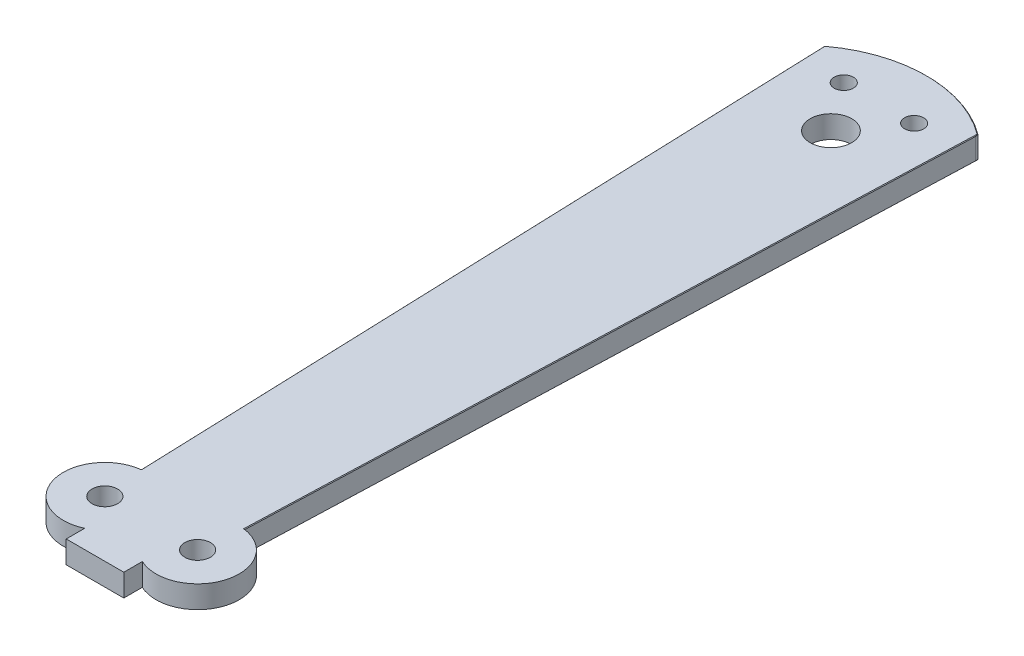
ISO-10303-21;
HEADER;
FILE_DESCRIPTION(('STEP AP214'),'2;1');
FILE_NAME('part.step','',(''),(''),'','','');
FILE_SCHEMA(('AUTOMOTIVE_DESIGN { 1 0 10303 214 1 1 1 1 }'));
ENDSEC;
DATA;
#1=APPLICATION_CONTEXT('core data for automotive mechanical design processes');
#2=APPLICATION_PROTOCOL_DEFINITION('international standard','automotive_design',2000,#1);
#3=PRODUCT_CONTEXT('',#1,'mechanical');
#4=PRODUCT('Part','Part','',(#3));
#5=PRODUCT_RELATED_PRODUCT_CATEGORY('part','',(#4));
#6=PRODUCT_DEFINITION_FORMATION('','',#4);
#7=PRODUCT_DEFINITION_CONTEXT('part definition',#1,'design');
#8=PRODUCT_DEFINITION('design','',#6,#7);
#9=PRODUCT_DEFINITION_SHAPE('','',#8);
#10=(LENGTH_UNIT() NAMED_UNIT(*) SI_UNIT(.MILLI.,.METRE.));
#11=(NAMED_UNIT(*) PLANE_ANGLE_UNIT() SI_UNIT($,.RADIAN.));
#12=(NAMED_UNIT(*) SI_UNIT($,.STERADIAN.) SOLID_ANGLE_UNIT());
#13=UNCERTAINTY_MEASURE_WITH_UNIT(LENGTH_MEASURE(1.E-05),#10,'distance_accuracy_value','');
#14=(GEOMETRIC_REPRESENTATION_CONTEXT(3) GLOBAL_UNCERTAINTY_ASSIGNED_CONTEXT((#13)) GLOBAL_UNIT_ASSIGNED_CONTEXT((#10,
#11,#12)) REPRESENTATION_CONTEXT('',''));
#15=CARTESIAN_POINT('',(0.,0.,0.));
#16=DIRECTION('',(0.,0.,1.));
#17=DIRECTION('',(1.,0.,0.));
#18=AXIS2_PLACEMENT_3D('',#15,#16,#17);
#19=CARTESIAN_POINT('',(0.,-1.75,20.));
#20=DIRECTION('',(0.,1.,0.));
#21=DIRECTION('',(0.,0.,1.));
#22=AXIS2_PLACEMENT_3D('',#19,#20,#21);
#23=CYLINDRICAL_SURFACE('',#22,20.);
#24=DIRECTION('',(0.,1.,0.));
#25=VECTOR('',#24,1.);
#26=CARTESIAN_POINT('',(11.9200497518595,-1.75,3.94034826301659));
#27=LINE('',#26,#25);
#28=CARTESIAN_POINT('',(11.9200497518595,1.65000000000001,3.94034826301659));
#29=VERTEX_POINT('',#28);
#30=CARTESIAN_POINT('',(11.9200497518595,-1.65,3.94034826301659));
#31=VERTEX_POINT('',#30);
#32=EDGE_CURVE('E259',#29,#31,#27,.F.);
#33=ORIENTED_EDGE('',*,*,#32,.T.);
#34=CARTESIAN_POINT('',(0.,-1.65,20.));
#35=DIRECTION('',(0.,-1.,0.));
#36=DIRECTION('',(0.,0.,-1.));
#37=AXIS2_PLACEMENT_3D('',#34,#35,#36);
#38=CIRCLE('',#37,20.);
#39=CARTESIAN_POINT('',(-11.693240419358,-1.65,3.77446061004157));
#40=VERTEX_POINT('',#39);
#41=EDGE_CURVE('E263',#31,#40,#38,.F.);
#42=ORIENTED_EDGE('',*,*,#41,.T.);
#43=DIRECTION('',(0.,1.,0.));
#44=VECTOR('',#43,1.);
#45=CARTESIAN_POINT('',(-11.693240419358,-1.75,3.77446061004157));
#46=LINE('',#45,#44);
#47=CARTESIAN_POINT('',(-11.693240419358,1.65000000000001,3.77446061004156));
#48=VERTEX_POINT('',#47);
#49=EDGE_CURVE('E256',#40,#48,#46,.T.);
#50=ORIENTED_EDGE('',*,*,#49,.T.);
#51=CARTESIAN_POINT('',(0.,1.65000000000001,20.));
#52=DIRECTION('',(0.,-1.,0.));
#53=DIRECTION('',(0.,0.,-1.));
#54=AXIS2_PLACEMENT_3D('',#51,#52,#53);
#55=CIRCLE('',#54,20.);
#56=EDGE_CURVE('E253',#48,#29,#55,.T.);
#57=ORIENTED_EDGE('',*,*,#56,.T.);
#58=EDGE_LOOP('',(#33,#42,#50,#57));
#59=FACE_BOUND('',#58,.T.);
#60=ADVANCED_FACE('F49',(#59),#23,.T.);
#61=CARTESIAN_POINT('',(12.,-1.75,4.));
#62=DIRECTION('',(0.999374674114514,0.,0.0353590262664188));
#63=DIRECTION('',(0.0353590262664188,0.,-0.999374674114514));
#64=AXIS2_PLACEMENT_3D('',#61,#62,#63);
#65=PLANE('',#64);
#66=DIRECTION('',(0.,1.,0.));
#67=VECTOR('',#66,1.);
#68=CARTESIAN_POINT('',(8.08082184465976,-1.75,114.770227728518));
#69=LINE('',#68,#67);
#70=CARTESIAN_POINT('',(8.08082184465976,-1.65,114.770227728518));
#71=VERTEX_POINT('',#70);
#72=CARTESIAN_POINT('',(8.08082184465976,1.65000000000001,114.770227728518));
#73=VERTEX_POINT('',#72);
#74=EDGE_CURVE('E228',#71,#73,#69,.T.);
#75=ORIENTED_EDGE('',*,*,#74,.F.);
#76=DIRECTION('',(0.0353590262664188,0.,-0.999374674114514));
#77=VECTOR('',#76,1.);
#78=CARTESIAN_POINT('',(12.,-1.65,4.));
#79=LINE('',#78,#77);
#80=CARTESIAN_POINT('',(11.9858210880633,-1.65,4.40074761644322));
#81=VERTEX_POINT('',#80);
#82=EDGE_CURVE('E250',#71,#81,#79,.T.);
#83=ORIENTED_EDGE('',*,*,#82,.T.);
#84=DIRECTION('',(0.,1.,0.));
#85=VECTOR('',#84,1.);
#86=CARTESIAN_POINT('',(11.9858210880633,-1.75,4.40074761644322));
#87=LINE('',#86,#85);
#88=CARTESIAN_POINT('',(11.9858210880633,1.65000000000001,4.40074761644322));
#89=VERTEX_POINT('',#88);
#90=EDGE_CURVE('E246',#81,#89,#87,.T.);
#91=ORIENTED_EDGE('',*,*,#90,.T.);
#92=DIRECTION('',(-0.0353590262664188,0.,0.999374674114514));
#93=VECTOR('',#92,1.);
#94=CARTESIAN_POINT('',(8.08082184465976,1.65000000000001,114.770227728518));
#95=LINE('',#94,#93);
#96=EDGE_CURVE('E232',#89,#73,#95,.T.);
#97=ORIENTED_EDGE('',*,*,#96,.T.);
#98=EDGE_LOOP('',(#75,#83,#91,#97));
#99=FACE_BOUND('',#98,.T.);
#100=ADVANCED_FACE('F405',(#99),#65,.T.);
#101=CARTESIAN_POINT('',(7.25000000000002,-1.75,121.216911764706));
#102=DIRECTION('',(0.,1.,0.));
#103=DIRECTION('',(0.,0.,1.));
#104=AXIS2_PLACEMENT_3D('',#101,#102,#103);
#105=CYLINDRICAL_SURFACE('',#104,6.5);
#106=CARTESIAN_POINT('',(7.25000000000002,-1.75,121.216911764706));
#107=DIRECTION('',(0.,1.,0.));
#108=DIRECTION('',(0.,0.,1.));
#109=AXIS2_PLACEMENT_3D('',#106,#107,#108);
#110=CIRCLE('',#109,6.5);
#111=CARTESIAN_POINT('',(4.49999999999998,-1.75,127.106521259401));
#112=VERTEX_POINT('',#111);
#113=CARTESIAN_POINT('',(7.98118594930824,-1.75,114.758168302736));
#114=VERTEX_POINT('',#113);
#115=EDGE_CURVE('E225',#112,#114,#110,.T.);
#116=ORIENTED_EDGE('',*,*,#115,.T.);
#117=CARTESIAN_POINT('',(7.25000000000002,-2.25235384008712,121.216911764706));
#118=DIRECTION('',(-0.706664609012429,0.707106781186588,-0.0250026072491366));
#119=DIRECTION('',(0.706664609012509,0.707106781186507,0.0250026072491394));
#120=AXIS2_PLACEMENT_3D('',#117,#118,#119);
#121=ELLIPSE('',#120,9.1923881554246,6.5);
#122=EDGE_CURVE('E292',#114,#71,#121,.F.);
#123=ORIENTED_EDGE('',*,*,#122,.T.);
#124=ORIENTED_EDGE('',*,*,#74,.T.);
#125=CARTESIAN_POINT('',(7.25000000000002,2.25235384008722,121.216911764706));
#126=DIRECTION('',(0.706664609012478,0.707106781186538,0.0250026072491383));
#127=DIRECTION('',(-0.70666460901246,0.707106781186557,-0.0250026072491377));
#128=AXIS2_PLACEMENT_3D('',#125,#126,#127);
#129=ELLIPSE('',#128,9.19238815542524,6.5);
#130=CARTESIAN_POINT('',(7.98118594930827,1.75,114.758168302736));
#131=VERTEX_POINT('',#130);
#132=EDGE_CURVE('E60',#73,#131,#129,.T.);
#133=ORIENTED_EDGE('',*,*,#132,.T.);
#134=CARTESIAN_POINT('',(7.25000000000002,1.75,121.216911764706));
#135=DIRECTION('',(0.,1.,0.));
#136=DIRECTION('',(0.,0.,1.));
#137=AXIS2_PLACEMENT_3D('',#134,#135,#136);
#138=CIRCLE('',#137,6.5);
#139=CARTESIAN_POINT('',(4.49999999999998,1.75,127.106521259401));
#140=VERTEX_POINT('',#139);
#141=EDGE_CURVE('E68',#140,#131,#138,.T.);
#142=ORIENTED_EDGE('',*,*,#141,.F.);
#143=DIRECTION('',(0.,1.,0.));
#144=VECTOR('',#143,1.);
#145=CARTESIAN_POINT('',(4.49999999999998,-1.75,127.106521259401));
#146=LINE('',#145,#144);
#147=EDGE_CURVE('E233',#112,#140,#146,.T.);
#148=ORIENTED_EDGE('',*,*,#147,.F.);
#149=EDGE_LOOP('',(#116,#123,#124,#133,#142,#148));
#150=FACE_BOUND('',#149,.T.);
#151=ADVANCED_FACE('F412',(#150),#105,.T.);
#152=CARTESIAN_POINT('',(4.5,-1.75,130.));
#153=DIRECTION('',(1.,0.,0.));
#154=DIRECTION('',(0.,0.,-1.));
#155=AXIS2_PLACEMENT_3D('',#152,#153,#154);
#156=PLANE('',#155);
#157=ORIENTED_EDGE('',*,*,#147,.T.);
#158=DIRECTION('',(0.,0.,-1.));
#159=VECTOR('',#158,1.);
#160=CARTESIAN_POINT('',(4.5,1.75,130.));
#161=LINE('',#160,#159);
#162=CARTESIAN_POINT('',(4.5,1.75,130.));
#163=VERTEX_POINT('',#162);
#164=EDGE_CURVE('E184',#163,#140,#161,.T.);
#165=ORIENTED_EDGE('',*,*,#164,.F.);
#166=DIRECTION('',(0.,1.,0.));
#167=VECTOR('',#166,1.);
#168=CARTESIAN_POINT('',(4.5,-1.75,130.));
#169=LINE('',#168,#167);
#170=CARTESIAN_POINT('',(4.5,-1.75,130.));
#171=VERTEX_POINT('',#170);
#172=EDGE_CURVE('E236',#171,#163,#169,.T.);
#173=ORIENTED_EDGE('',*,*,#172,.F.);
#174=DIRECTION('',(0.,0.,-1.));
#175=VECTOR('',#174,1.);
#176=CARTESIAN_POINT('',(4.5,-1.75,130.));
#177=LINE('',#176,#175);
#178=EDGE_CURVE('E221',#171,#112,#177,.T.);
#179=ORIENTED_EDGE('',*,*,#178,.T.);
#180=EDGE_LOOP('',(#157,#165,#173,#179));
#181=FACE_BOUND('',#180,.T.);
#182=ADVANCED_FACE('F531',(#181),#156,.T.);
#183=CARTESIAN_POINT('',(-4.49999999999997,-1.75,130.));
#184=DIRECTION('',(0.,0.,1.));
#185=DIRECTION('',(1.,0.,0.));
#186=AXIS2_PLACEMENT_3D('',#183,#184,#185);
#187=PLANE('',#186);
#188=ORIENTED_EDGE('',*,*,#172,.T.);
#189=DIRECTION('',(1.,0.,0.));
#190=VECTOR('',#189,1.);
#191=CARTESIAN_POINT('',(-4.49999999999997,1.75,130.));
#192=LINE('',#191,#190);
#193=CARTESIAN_POINT('',(-4.49999999999997,1.75,130.));
#194=VERTEX_POINT('',#193);
#195=EDGE_CURVE('E181',#194,#163,#192,.T.);
#196=ORIENTED_EDGE('',*,*,#195,.F.);
#197=DIRECTION('',(0.,1.,0.));
#198=VECTOR('',#197,1.);
#199=CARTESIAN_POINT('',(-4.49999999999997,-1.75,130.));
#200=LINE('',#199,#198);
#201=CARTESIAN_POINT('',(-4.49999999999997,-1.75,130.));
#202=VERTEX_POINT('',#201);
#203=EDGE_CURVE('E164',#202,#194,#200,.T.);
#204=ORIENTED_EDGE('',*,*,#203,.F.);
#205=DIRECTION('',(1.,0.,0.));
#206=VECTOR('',#205,1.);
#207=CARTESIAN_POINT('',(-4.49999999999997,-1.75,130.));
#208=LINE('',#207,#206);
#209=EDGE_CURVE('E217',#202,#171,#208,.T.);
#210=ORIENTED_EDGE('',*,*,#209,.T.);
#211=EDGE_LOOP('',(#188,#196,#204,#210));
#212=FACE_BOUND('',#211,.T.);
#213=ADVANCED_FACE('F535',(#212),#187,.T.);
#214=CARTESIAN_POINT('',(-4.49999999999997,-1.75,130.));
#215=DIRECTION('',(-1.,0.,0.));
#216=DIRECTION('',(0.,0.,1.));
#217=AXIS2_PLACEMENT_3D('',#214,#215,#216);
#218=PLANE('',#217);
#219=ORIENTED_EDGE('',*,*,#203,.T.);
#220=DIRECTION('',(0.,0.,1.));
#221=VECTOR('',#220,1.);
#222=CARTESIAN_POINT('',(-4.49999999999997,1.75,130.));
#223=LINE('',#222,#221);
#224=CARTESIAN_POINT('',(-4.49999999999998,1.75,127.106521259401));
#225=VERTEX_POINT('',#224);
#226=EDGE_CURVE('E171',#225,#194,#223,.T.);
#227=ORIENTED_EDGE('',*,*,#226,.F.);
#228=DIRECTION('',(0.,1.,0.));
#229=VECTOR('',#228,1.);
#230=CARTESIAN_POINT('',(-4.49999999999998,-1.75,127.106521259401));
#231=LINE('',#230,#229);
#232=CARTESIAN_POINT('',(-4.49999999999998,-1.75,127.106521259401));
#233=VERTEX_POINT('',#232);
#234=EDGE_CURVE('E152',#233,#225,#231,.T.);
#235=ORIENTED_EDGE('',*,*,#234,.F.);
#236=DIRECTION('',(0.,0.,1.));
#237=VECTOR('',#236,1.);
#238=CARTESIAN_POINT('',(-4.49999999999997,-1.75,130.));
#239=LINE('',#238,#237);
#240=EDGE_CURVE('E214',#233,#202,#239,.T.);
#241=ORIENTED_EDGE('',*,*,#240,.T.);
#242=EDGE_LOOP('',(#219,#227,#235,#241));
#243=FACE_BOUND('',#242,.T.);
#244=ADVANCED_FACE('F179',(#243),#218,.T.);
#245=CARTESIAN_POINT('',(-7.24999999999999,-1.75,121.216911764706));
#246=DIRECTION('',(0.,1.,0.));
#247=DIRECTION('',(0.,0.,1.));
#248=AXIS2_PLACEMENT_3D('',#245,#246,#247);
#249=CYLINDRICAL_SURFACE('',#248,6.50000000000003);
#250=ORIENTED_EDGE('',*,*,#234,.T.);
#251=CARTESIAN_POINT('',(-7.24999999999999,1.75,121.216911764706));
#252=DIRECTION('',(0.,1.,0.));
#253=DIRECTION('',(0.,0.,-1.));
#254=AXIS2_PLACEMENT_3D('',#251,#252,#253);
#255=CIRCLE('',#254,6.50000000000003);
#256=CARTESIAN_POINT('',(-7.9793017828512,1.75,114.757955277042));
#257=VERTEX_POINT('',#256);
#258=EDGE_CURVE('E155',#257,#225,#255,.T.);
#259=ORIENTED_EDGE('',*,*,#258,.F.);
#260=CARTESIAN_POINT('',(-7.24999999999999,2.2503527734161,121.216911764706));
#261=DIRECTION('',(-0.70666418242249,0.707106781186523,0.02501466132469));
#262=DIRECTION('',(0.706664182422441,0.707106781186572,-0.0250146613246882));
#263=AXIS2_PLACEMENT_3D('',#260,#261,#262);
#264=ELLIPSE('',#263,9.19238815542548,6.50000000000003);
#265=CARTESIAN_POINT('',(-8.07893857345164,1.65000000000001,114.769985299991));
#266=VERTEX_POINT('',#265);
#267=EDGE_CURVE('E11',#257,#266,#264,.T.);
#268=ORIENTED_EDGE('',*,*,#267,.T.);
#269=DIRECTION('',(0.,1.,0.));
#270=VECTOR('',#269,1.);
#271=CARTESIAN_POINT('',(-8.07893857345164,-1.75,114.769985299991));
#272=LINE('',#271,#270);
#273=CARTESIAN_POINT('',(-8.07893857345164,-1.65,114.769985299991));
#274=VERTEX_POINT('',#273);
#275=EDGE_CURVE('E165',#274,#266,#272,.T.);
#276=ORIENTED_EDGE('',*,*,#275,.F.);
#277=CARTESIAN_POINT('',(-7.24999999999999,-2.250352773416,121.216911764706));
#278=DIRECTION('',(0.706664182422441,0.707106781186572,-0.0250146613246882));
#279=DIRECTION('',(-0.70666418242249,0.707106781186523,0.02501466132469));
#280=AXIS2_PLACEMENT_3D('',#277,#278,#279);
#281=ELLIPSE('',#280,9.19238815542484,6.50000000000003);
#282=CARTESIAN_POINT('',(-7.97930178285117,-1.75,114.757955277042));
#283=VERTEX_POINT('',#282);
#284=EDGE_CURVE('E295',#274,#283,#281,.F.);
#285=ORIENTED_EDGE('',*,*,#284,.T.);
#286=CARTESIAN_POINT('',(-7.24999999999999,-1.75,121.216911764706));
#287=DIRECTION('',(0.,1.,0.));
#288=DIRECTION('',(0.,0.,-1.));
#289=AXIS2_PLACEMENT_3D('',#286,#287,#288);
#290=CIRCLE('',#289,6.50000000000003);
#291=EDGE_CURVE('E158',#283,#233,#290,.T.);
#292=ORIENTED_EDGE('',*,*,#291,.T.);
#293=EDGE_LOOP('',(#250,#259,#268,#276,#285,#292));
#294=FACE_BOUND('',#293,.T.);
#295=ADVANCED_FACE('F154',(#294),#249,.T.);
#296=CARTESIAN_POINT('',(-12.,-1.75,4.));
#297=DIRECTION('',(-0.999374070825145,0.,0.0353760733035451));
#298=DIRECTION('',(0.0353760733035451,0.,0.999374070825145));
#299=AXIS2_PLACEMENT_3D('',#296,#297,#298);
#300=PLANE('',#299);
#301=DIRECTION('',(0.,-1.,0.));
#302=VECTOR('',#301,1.);
#303=CARTESIAN_POINT('',(-11.9964623926696,-1.75,4.09993740708252));
#304=LINE('',#303,#302);
#305=CARTESIAN_POINT('',(-11.9964623926696,1.65000000000001,4.09993740708252));
#306=VERTEX_POINT('',#305);
#307=CARTESIAN_POINT('',(-11.9964623926696,-1.65,4.09993740708252));
#308=VERTEX_POINT('',#307);
#309=EDGE_CURVE('E269',#306,#308,#304,.T.);
#310=ORIENTED_EDGE('',*,*,#309,.T.);
#311=DIRECTION('',(0.0353760733035451,0.,0.999374070825145));
#312=VECTOR('',#311,1.);
#313=CARTESIAN_POINT('',(-12.,-1.65,4.));
#314=LINE('',#313,#312);
#315=EDGE_CURVE('E272',#308,#274,#314,.T.);
#316=ORIENTED_EDGE('',*,*,#315,.T.);
#317=ORIENTED_EDGE('',*,*,#275,.T.);
#318=DIRECTION('',(-0.0353760733035451,0.,-0.999374070825145));
#319=VECTOR('',#318,1.);
#320=CARTESIAN_POINT('',(-12.,1.65000000000001,4.));
#321=LINE('',#320,#319);
#322=EDGE_CURVE('E266',#266,#306,#321,.T.);
#323=ORIENTED_EDGE('',*,*,#322,.T.);
#324=EDGE_LOOP('',(#310,#316,#317,#323));
#325=FACE_BOUND('',#324,.T.);
#326=ADVANCED_FACE('F416',(#325),#300,.T.);
#327=CARTESIAN_POINT('',(0.,-1.75,20.));
#328=DIRECTION('',(0.,-1.,0.));
#329=DIRECTION('',(0.,0.,-1.));
#330=AXIS2_PLACEMENT_3D('',#327,#328,#329);
#331=PLANE('',#330);
#332=CARTESIAN_POINT('',(0.,-1.75,15.));
#333=DIRECTION('',(0.,1.,0.));
#334=DIRECTION('',(0.,0.,1.));
#335=AXIS2_PLACEMENT_3D('',#332,#333,#334);
#336=CIRCLE('',#335,3.25);
#337=CARTESIAN_POINT('',(0.,-1.75,18.25));
#338=VERTEX_POINT('',#337);
#339=EDGE_CURVE('E192',#338,#338,#336,.T.);
#340=ORIENTED_EDGE('',*,*,#339,.T.);
#341=EDGE_LOOP('',(#340));
#342=FACE_BOUND('',#341,.T.);
#343=CARTESIAN_POINT('',(7.25000000000002,-1.75,121.216911764706));
#344=DIRECTION('',(0.,1.,0.));
#345=DIRECTION('',(0.,0.,-1.));
#346=AXIS2_PLACEMENT_3D('',#343,#344,#345);
#347=CIRCLE('',#346,2.);
#348=CARTESIAN_POINT('',(7.25000000000002,-1.75,119.216911764706));
#349=VERTEX_POINT('',#348);
#350=EDGE_CURVE('E196',#349,#349,#347,.T.);
#351=ORIENTED_EDGE('',*,*,#350,.T.);
#352=EDGE_LOOP('',(#351));
#353=FACE_BOUND('',#352,.T.);
#354=CARTESIAN_POINT('',(-5.5,-1.75,7.5));
#355=DIRECTION('',(0.,1.,0.));
#356=DIRECTION('',(0.,0.,1.));
#357=AXIS2_PLACEMENT_3D('',#354,#355,#356);
#358=CIRCLE('',#357,1.5);
#359=CARTESIAN_POINT('',(-5.5,-1.75,9.));
#360=VERTEX_POINT('',#359);
#361=EDGE_CURVE('E200',#360,#360,#358,.T.);
#362=ORIENTED_EDGE('',*,*,#361,.T.);
#363=EDGE_LOOP('',(#362));
#364=FACE_BOUND('',#363,.T.);
#365=CARTESIAN_POINT('',(5.5,-1.75,7.5));
#366=DIRECTION('',(0.,1.,0.));
#367=DIRECTION('',(0.,0.,-1.));
#368=AXIS2_PLACEMENT_3D('',#365,#366,#367);
#369=CIRCLE('',#368,1.5);
#370=CARTESIAN_POINT('',(5.5,-1.75,6.));
#371=VERTEX_POINT('',#370);
#372=EDGE_CURVE('E204',#371,#371,#369,.T.);
#373=ORIENTED_EDGE('',*,*,#372,.T.);
#374=EDGE_LOOP('',(#373));
#375=FACE_BOUND('',#374,.T.);
#376=CARTESIAN_POINT('',(-7.24999999999999,-1.75,121.216911764706));
#377=DIRECTION('',(0.,1.,0.));
#378=DIRECTION('',(0.,0.,1.));
#379=AXIS2_PLACEMENT_3D('',#376,#377,#378);
#380=CIRCLE('',#379,2.);
#381=CARTESIAN_POINT('',(-7.24999999999999,-1.75,123.216911764706));
#382=VERTEX_POINT('',#381);
#383=EDGE_CURVE('E208',#382,#382,#380,.T.);
#384=ORIENTED_EDGE('',*,*,#383,.T.);
#385=EDGE_LOOP('',(#384));
#386=FACE_BOUND('',#385,.T.);
#387=DIRECTION('',(-0.0353590262664188,0.,0.999374674114514));
#388=VECTOR('',#387,1.);
#389=CARTESIAN_POINT('',(11.3196687580943,-1.75,20.4005029097813));
#390=LINE('',#389,#388);
#391=CARTESIAN_POINT('',(11.8982127705201,-1.75,4.0487451005436));
#392=VERTEX_POINT('',#391);
#393=EDGE_CURVE('E281',#392,#114,#390,.T.);
#394=ORIENTED_EDGE('',*,*,#393,.T.);
#395=ORIENTED_EDGE('',*,*,#115,.F.);
#396=ORIENTED_EDGE('',*,*,#178,.F.);
#397=ORIENTED_EDGE('',*,*,#209,.F.);
#398=ORIENTED_EDGE('',*,*,#240,.F.);
#399=ORIENTED_EDGE('',*,*,#291,.F.);
#400=DIRECTION('',(-0.0353760733035451,0.,-0.999374070825145));
#401=VECTOR('',#400,1.);
#402=CARTESIAN_POINT('',(-11.3193821079742,-1.75,20.4006860923177));
#403=LINE('',#402,#401);
#404=CARTESIAN_POINT('',(-11.8982119005647,-1.75,4.04874445163457));
#405=VERTEX_POINT('',#404);
#406=EDGE_CURVE('E275',#283,#405,#403,.T.);
#407=ORIENTED_EDGE('',*,*,#406,.T.);
#408=CARTESIAN_POINT('',(0.,-1.75,20.));
#409=DIRECTION('',(0.,-1.,0.));
#410=DIRECTION('',(0.,0.,-1.));
#411=AXIS2_PLACEMENT_3D('',#408,#409,#410);
#412=CIRCLE('',#411,19.9);
#413=EDGE_CURVE('E278',#405,#392,#412,.T.);
#414=ORIENTED_EDGE('',*,*,#413,.T.);
#415=EDGE_LOOP('',(#394,#395,#396,#397,#398,#399,#407,#414));
#416=FACE_BOUND('',#415,.T.);
#417=ADVANCED_FACE('F524',(#342,#353,#364,#375,#386,#416),#331,.T.);
#418=CARTESIAN_POINT('',(-7.24999999999999,-1.75,121.216911764706));
#419=DIRECTION('',(0.,1.,0.));
#420=DIRECTION('',(0.,0.,1.));
#421=AXIS2_PLACEMENT_3D('',#418,#419,#420);
#422=CYLINDRICAL_SURFACE('',#421,2.);
#423=ORIENTED_EDGE('',*,*,#383,.F.);
#424=EDGE_LOOP('',(#423));
#425=FACE_BOUND('',#424,.T.);
#426=CARTESIAN_POINT('',(-7.24999999999999,1.75,121.216911764706));
#427=DIRECTION('',(0.,1.,0.));
#428=DIRECTION('',(0.,0.,1.));
#429=AXIS2_PLACEMENT_3D('',#426,#427,#428);
#430=CIRCLE('',#429,2.);
#431=CARTESIAN_POINT('',(-7.24999999999999,1.75,123.216911764706));
#432=VERTEX_POINT('',#431);
#433=EDGE_CURVE('E177',#432,#432,#430,.T.);
#434=ORIENTED_EDGE('',*,*,#433,.T.);
#435=EDGE_LOOP('',(#434));
#436=FACE_BOUND('',#435,.T.);
#437=ADVANCED_FACE('F491',(#425,#436),#422,.F.);
#438=CARTESIAN_POINT('',(5.5,-1.75,7.5));
#439=DIRECTION('',(0.,1.,0.));
#440=DIRECTION('',(0.,0.,1.));
#441=AXIS2_PLACEMENT_3D('',#438,#439,#440);
#442=CYLINDRICAL_SURFACE('',#441,1.5);
#443=ORIENTED_EDGE('',*,*,#372,.F.);
#444=EDGE_LOOP('',(#443));
#445=FACE_BOUND('',#444,.T.);
#446=CARTESIAN_POINT('',(5.5,1.75,7.5));
#447=DIRECTION('',(0.,1.,0.));
#448=DIRECTION('',(0.,0.,-1.));
#449=AXIS2_PLACEMENT_3D('',#446,#447,#448);
#450=CIRCLE('',#449,1.5);
#451=CARTESIAN_POINT('',(5.5,1.75,6.));
#452=VERTEX_POINT('',#451);
#453=EDGE_CURVE('E483',#452,#452,#450,.T.);
#454=ORIENTED_EDGE('',*,*,#453,.T.);
#455=EDGE_LOOP('',(#454));
#456=FACE_BOUND('',#455,.T.);
#457=ADVANCED_FACE('F517',(#445,#456),#442,.F.);
#458=CARTESIAN_POINT('',(-5.5,-1.75,7.5));
#459=DIRECTION('',(0.,1.,0.));
#460=DIRECTION('',(0.,0.,1.));
#461=AXIS2_PLACEMENT_3D('',#458,#459,#460);
#462=CYLINDRICAL_SURFACE('',#461,1.5);
#463=ORIENTED_EDGE('',*,*,#361,.F.);
#464=EDGE_LOOP('',(#463));
#465=FACE_BOUND('',#464,.T.);
#466=CARTESIAN_POINT('',(-5.5,1.75,7.5));
#467=DIRECTION('',(0.,1.,0.));
#468=DIRECTION('',(0.,0.,1.));
#469=AXIS2_PLACEMENT_3D('',#466,#467,#468);
#470=CIRCLE('',#469,1.5);
#471=CARTESIAN_POINT('',(-5.5,1.75,9.));
#472=VERTEX_POINT('',#471);
#473=EDGE_CURVE('E479',#472,#472,#470,.T.);
#474=ORIENTED_EDGE('',*,*,#473,.T.);
#475=EDGE_LOOP('',(#474));
#476=FACE_BOUND('',#475,.T.);
#477=ADVANCED_FACE('F510',(#465,#476),#462,.F.);
#478=CARTESIAN_POINT('',(7.25000000000002,-1.75,121.216911764706));
#479=DIRECTION('',(0.,1.,0.));
#480=DIRECTION('',(0.,0.,1.));
#481=AXIS2_PLACEMENT_3D('',#478,#479,#480);
#482=CYLINDRICAL_SURFACE('',#481,2.);
#483=ORIENTED_EDGE('',*,*,#350,.F.);
#484=EDGE_LOOP('',(#483));
#485=FACE_BOUND('',#484,.T.);
#486=CARTESIAN_POINT('',(7.25000000000002,1.75,121.216911764706));
#487=DIRECTION('',(0.,1.,0.));
#488=DIRECTION('',(0.,0.,-1.));
#489=AXIS2_PLACEMENT_3D('',#486,#487,#488);
#490=CIRCLE('',#489,2.);
#491=CARTESIAN_POINT('',(7.25000000000002,1.75,119.216911764706));
#492=VERTEX_POINT('',#491);
#493=EDGE_CURVE('E475',#492,#492,#490,.T.);
#494=ORIENTED_EDGE('',*,*,#493,.T.);
#495=EDGE_LOOP('',(#494));
#496=FACE_BOUND('',#495,.T.);
#497=ADVANCED_FACE('F504',(#485,#496),#482,.F.);
#498=CARTESIAN_POINT('',(0.,-1.75,15.));
#499=DIRECTION('',(0.,1.,0.));
#500=DIRECTION('',(0.,0.,1.));
#501=AXIS2_PLACEMENT_3D('',#498,#499,#500);
#502=CYLINDRICAL_SURFACE('',#501,3.25);
#503=ORIENTED_EDGE('',*,*,#339,.F.);
#504=EDGE_LOOP('',(#503));
#505=FACE_BOUND('',#504,.T.);
#506=CARTESIAN_POINT('',(0.,1.75,15.));
#507=DIRECTION('',(0.,1.,0.));
#508=DIRECTION('',(0.,0.,1.));
#509=AXIS2_PLACEMENT_3D('',#506,#507,#508);
#510=CIRCLE('',#509,3.25);
#511=CARTESIAN_POINT('',(0.,1.75,18.25));
#512=VERTEX_POINT('',#511);
#513=EDGE_CURVE('E472',#512,#512,#510,.T.);
#514=ORIENTED_EDGE('',*,*,#513,.T.);
#515=EDGE_LOOP('',(#514));
#516=FACE_BOUND('',#515,.T.);
#517=ADVANCED_FACE('F494',(#505,#516),#502,.F.);
#518=CARTESIAN_POINT('',(0.,1.75,20.));
#519=DIRECTION('',(0.,-1.,0.));
#520=DIRECTION('',(0.,0.,-1.));
#521=AXIS2_PLACEMENT_3D('',#518,#519,#520);
#522=PLANE('',#521);
#523=ORIENTED_EDGE('',*,*,#141,.T.);
#524=DIRECTION('',(0.0353590262664188,0.,-0.999374674114514));
#525=VECTOR('',#524,1.);
#526=CARTESIAN_POINT('',(11.9000625325886,1.75,3.99646409737336));
#527=LINE('',#526,#525);
#528=CARTESIAN_POINT('',(11.8982127705201,1.75,4.04874510054358));
#529=VERTEX_POINT('',#528);
#530=EDGE_CURVE('E73',#131,#529,#527,.T.);
#531=ORIENTED_EDGE('',*,*,#530,.T.);
#532=CARTESIAN_POINT('',(0.,1.75,20.));
#533=DIRECTION('',(0.,-1.,0.));
#534=DIRECTION('',(0.,0.,-1.));
#535=AXIS2_PLACEMENT_3D('',#532,#533,#534);
#536=CIRCLE('',#535,19.9);
#537=CARTESIAN_POINT('',(-11.8982119005648,1.75,4.04874445163455));
#538=VERTEX_POINT('',#537);
#539=EDGE_CURVE('E287',#529,#538,#536,.F.);
#540=ORIENTED_EDGE('',*,*,#539,.T.);
#541=DIRECTION('',(0.0353760733035451,0.,0.999374070825145));
#542=VECTOR('',#541,1.);
#543=CARTESIAN_POINT('',(-7.97900116636915,1.75,114.76644769266));
#544=LINE('',#543,#542);
#545=EDGE_CURVE('E174',#538,#257,#544,.T.);
#546=ORIENTED_EDGE('',*,*,#545,.T.);
#547=ORIENTED_EDGE('',*,*,#258,.T.);
#548=ORIENTED_EDGE('',*,*,#226,.T.);
#549=ORIENTED_EDGE('',*,*,#195,.T.);
#550=ORIENTED_EDGE('',*,*,#164,.T.);
#551=EDGE_LOOP('',(#523,#531,#540,#546,#547,#548,#549,#550));
#552=FACE_BOUND('',#551,.T.);
#553=ORIENTED_EDGE('',*,*,#433,.F.);
#554=EDGE_LOOP('',(#553));
#555=FACE_BOUND('',#554,.T.);
#556=ORIENTED_EDGE('',*,*,#453,.F.);
#557=EDGE_LOOP('',(#556));
#558=FACE_BOUND('',#557,.T.);
#559=ORIENTED_EDGE('',*,*,#473,.F.);
#560=EDGE_LOOP('',(#559));
#561=FACE_BOUND('',#560,.T.);
#562=ORIENTED_EDGE('',*,*,#493,.F.);
#563=EDGE_LOOP('',(#562));
#564=FACE_BOUND('',#563,.T.);
#565=ORIENTED_EDGE('',*,*,#513,.F.);
#566=EDGE_LOOP('',(#565));
#567=FACE_BOUND('',#566,.T.);
#568=ADVANCED_FACE('F168',(#552,#555,#558,#561,#564,#567),#522,.F.);
#569=CARTESIAN_POINT('',(-12.,-1.65,4.));
#570=DIRECTION('',(0.706664182422441,0.707106781186572,-0.0250146613246882));
#571=DIRECTION('',(0.0353760733035451,0.,0.999374070825145));
#572=AXIS2_PLACEMENT_3D('',#569,#570,#571);
#573=PLANE('',#572);
#574=ORIENTED_EDGE('',*,*,#284,.F.);
#575=ORIENTED_EDGE('',*,*,#315,.F.);
#576=DIRECTION('',(0.658319648012177,-0.670042087228687,-0.343014347197532));
#577=VECTOR('',#576,1.);
#578=CARTESIAN_POINT('',(-11.9964623926696,-1.65,4.09993740708252));
#579=LINE('',#578,#577);
#580=EDGE_CURVE('E466',#405,#308,#579,.F.);
#581=ORIENTED_EDGE('',*,*,#580,.F.);
#582=ORIENTED_EDGE('',*,*,#406,.F.);
#583=EDGE_LOOP('',(#574,#575,#581,#582));
#584=FACE_BOUND('',#583,.T.);
#585=ADVANCED_FACE('F52',(#584),#573,.F.);
#586=CARTESIAN_POINT('',(-11.3193821079742,1.75,20.4006860923177));
#587=DIRECTION('',(-0.70666418242249,0.707106781186523,0.02501466132469));
#588=DIRECTION('',(-0.0353760733035451,0.,-0.999374070825145));
#589=AXIS2_PLACEMENT_3D('',#586,#587,#588);
#590=PLANE('',#589);
#591=ORIENTED_EDGE('',*,*,#267,.F.);
#592=ORIENTED_EDGE('',*,*,#545,.F.);
#593=DIRECTION('',(0.658319648012084,0.670042087228693,-0.343014347197697));
#594=VECTOR('',#593,1.);
#595=CARTESIAN_POINT('',(-11.7915536914437,1.85855742992836,3.99317069489585));
#596=LINE('',#595,#594);
#597=EDGE_CURVE('E463',#306,#538,#596,.T.);
#598=ORIENTED_EDGE('',*,*,#597,.F.);
#599=ORIENTED_EDGE('',*,*,#322,.F.);
#600=EDGE_LOOP('',(#591,#592,#598,#599));
#601=FACE_BOUND('',#600,.T.);
#602=ADVANCED_FACE('F394',(#601),#590,.T.);
#603=CARTESIAN_POINT('',(-11.693240419358,-1.75,3.77446061004157));
#604=DIRECTION('',(0.731678843747156,0.,0.681649521097774));
#605=DIRECTION('',(0.,1.,0.));
#606=AXIS2_PLACEMENT_3D('',#603,#604,#605);
#607=PLANE('',#606);
#608=DIRECTION('',(-0.681649521097774,0.,0.731678843747156));
#609=VECTOR('',#608,1.);
#610=CARTESIAN_POINT('',(-11.9964623926696,-1.65,4.09993740708252));
#611=LINE('',#610,#609);
#612=EDGE_CURVE('E54',#308,#40,#611,.F.);
#613=ORIENTED_EDGE('',*,*,#612,.F.);
#614=ORIENTED_EDGE('',*,*,#309,.F.);
#615=DIRECTION('',(0.681649521097774,0.,-0.731678843747156));
#616=VECTOR('',#615,1.);
#617=CARTESIAN_POINT('',(-11.693240419358,1.65000000000001,3.77446061004157));
#618=LINE('',#617,#616);
#619=EDGE_CURVE('E460',#48,#306,#618,.F.);
#620=ORIENTED_EDGE('',*,*,#619,.F.);
#621=ORIENTED_EDGE('',*,*,#49,.F.);
#622=EDGE_LOOP('',(#613,#614,#620,#621));
#623=FACE_BOUND('',#622,.T.);
#624=ADVANCED_FACE('F388',(#623),#607,.F.);
#625=CARTESIAN_POINT('',(-11.9964623926696,-1.65,4.09993740708252));
#626=DIRECTION('',(-0.68623119206463,-0.346944146273394,-0.639309401154232));
#627=DIRECTION('',(-0.681649521097778,0.,0.731678843747152));
#628=AXIS2_PLACEMENT_3D('',#625,#626,#627);
#629=PLANE('',#628);
#630=ORIENTED_EDGE('',*,*,#580,.T.);
#631=ORIENTED_EDGE('',*,*,#612,.T.);
#632=CARTESIAN_POINT('',(-11.693240419358,-1.65,3.77446061004157));
#633=CARTESIAN_POINT('',(-11.7270829988635,-1.66730749096241,3.82017957850966));
#634=CARTESIAN_POINT('',(-11.7610852438168,-1.68429456904877,3.86589604746619));
#635=CARTESIAN_POINT('',(-11.8294090708276,-1.71762790249858,3.95732399466477));
#636=CARTESIAN_POINT('',(-11.8637306529433,-1.73397415774556,4.00303547290591));
#637=CARTESIAN_POINT('',(-11.8982119005647,-1.75000000000001,4.04874445163457));
#638=B_SPLINE_CURVE_WITH_KNOTS('',3,(#632,#633,#634,#635,#636,#637),.UNSPECIFIED.,.F.,.F.,(4,2,
4),(0.,0.178360256667873,0.35672054575323),.UNSPECIFIED.);
#639=EDGE_CURVE('E347',#405,#40,#638,.F.);
#640=ORIENTED_EDGE('',*,*,#639,.F.);
#641=EDGE_LOOP('',(#630,#631,#640));
#642=FACE_BOUND('',#641,.T.);
#643=ADVANCED_FACE('F368',(#642),#629,.T.);
#644=CARTESIAN_POINT('',(-11.693240419358,1.65000000000001,3.77446061004156));
#645=DIRECTION('',(-0.686231192064693,0.346944146273175,-0.639309401154283));
#646=DIRECTION('',(-0.681649521097774,0.,0.731678843747157));
#647=AXIS2_PLACEMENT_3D('',#644,#645,#646);
#648=PLANE('',#647);
#649=ORIENTED_EDGE('',*,*,#619,.T.);
#650=ORIENTED_EDGE('',*,*,#597,.T.);
#651=CARTESIAN_POINT('',(-11.8982119005648,1.75,4.04874445163455));
#652=CARTESIAN_POINT('',(-11.8637306529434,1.73397415774555,4.00303547290589));
#653=CARTESIAN_POINT('',(-11.8294090708277,1.71762790249858,3.95732399466476));
#654=CARTESIAN_POINT('',(-11.7610852438168,1.68429456904877,3.86589604746619));
#655=CARTESIAN_POINT('',(-11.7270829988635,1.66730749096242,3.82017957850966));
#656=CARTESIAN_POINT('',(-11.693240419358,1.65000000000001,3.77446061004156));
#657=B_SPLINE_CURVE_WITH_KNOTS('',3,(#651,#652,#653,#654,#655,#656),.UNSPECIFIED.,.F.,.F.,(4,2,
4),(0.,0.178360289085356,0.356720545753229),.UNSPECIFIED.);
#658=EDGE_CURVE('E337',#48,#538,#657,.F.);
#659=ORIENTED_EDGE('',*,*,#658,.F.);
#660=EDGE_LOOP('',(#649,#650,#659));
#661=FACE_BOUND('',#660,.T.);
#662=ADVANCED_FACE('F360',(#661),#648,.T.);
#663=CARTESIAN_POINT('',(0.,-1.65,20.));
#664=DIRECTION('',(0.,1.,0.));
#665=DIRECTION('',(0.,0.,1.));
#666=AXIS2_PLACEMENT_3D('',#663,#664,#665);
#667=CONICAL_SURFACE('',#666,20.,0.7853981633975);
#668=ORIENTED_EDGE('',*,*,#639,.T.);
#669=ORIENTED_EDGE('',*,*,#41,.F.);
#670=CARTESIAN_POINT('',(11.8982127705201,-1.75,4.0487451005436));
#671=CARTESIAN_POINT('',(11.9018490724322,-1.73333947778237,4.03067264883524));
#672=CARTESIAN_POINT('',(11.9054869718334,-1.71667588333947,4.01260335318634));
#673=CARTESIAN_POINT('',(11.9127659656132,-1.68334255000614,3.97647107401067));
#674=CARTESIAN_POINT('',(11.9164070599919,-1.6666728111157,3.9584080904839));
#675=CARTESIAN_POINT('',(11.9200497518595,-1.65,3.94034826301659));
#676=B_SPLINE_CURVE_WITH_KNOTS('',3,(#670,#671,#672,#673,#674,#675),.UNSPECIFIED.,.F.,.F.,(4,2,
4),(0.,0.074543156852392,0.1490863136915),.UNSPECIFIED.);
#677=EDGE_CURVE('E348',#392,#31,#676,.T.);
#678=ORIENTED_EDGE('',*,*,#677,.F.);
#679=ORIENTED_EDGE('',*,*,#413,.F.);
#680=EDGE_LOOP('',(#668,#669,#678,#679));
#681=FACE_BOUND('',#680,.T.);
#682=ADVANCED_FACE('F367',(#681),#667,.T.);
#683=CARTESIAN_POINT('',(12.,-1.65,4.));
#684=DIRECTION('',(-0.706664609012429,0.707106781186588,-0.0250026072491366));
#685=DIRECTION('',(0.0353590262664188,0.,-0.999374674114514));
#686=AXIS2_PLACEMENT_3D('',#683,#684,#685);
#687=PLANE('',#686);
#688=ORIENTED_EDGE('',*,*,#122,.F.);
#689=ORIENTED_EDGE('',*,*,#393,.F.);
#690=DIRECTION('',(0.232832107909593,0.265764843383441,0.93549893508638));
#691=VECTOR('',#690,1.);
#692=CARTESIAN_POINT('',(11.8819740601529,-1.76853558066467,3.98349939026736));
#693=LINE('',#692,#691);
#694=EDGE_CURVE('E438',#81,#392,#693,.F.);
#695=ORIENTED_EDGE('',*,*,#694,.F.);
#696=ORIENTED_EDGE('',*,*,#82,.F.);
#697=EDGE_LOOP('',(#688,#689,#695,#696));
#698=FACE_BOUND('',#697,.T.);
#699=ADVANCED_FACE('F376',(#698),#687,.F.);
#700=CARTESIAN_POINT('',(11.3196687580943,1.75,20.4005029097813));
#701=DIRECTION('',(0.706664609012478,0.707106781186538,0.0250026072491383));
#702=DIRECTION('',(-0.0353590262664188,0.,0.999374674114514));
#703=AXIS2_PLACEMENT_3D('',#700,#701,#702);
#704=PLANE('',#703);
#705=ORIENTED_EDGE('',*,*,#132,.F.);
#706=ORIENTED_EDGE('',*,*,#96,.F.);
#707=DIRECTION('',(0.232832107909518,-0.265764843383404,0.935498935086409));
#708=VECTOR('',#707,1.);
#709=CARTESIAN_POINT('',(11.9858210880633,1.65000000000001,4.40074761644322));
#710=LINE('',#709,#708);
#711=EDGE_CURVE('E316',#529,#89,#710,.T.);
#712=ORIENTED_EDGE('',*,*,#711,.F.);
#713=ORIENTED_EDGE('',*,*,#530,.F.);
#714=EDGE_LOOP('',(#705,#706,#712,#713));
#715=FACE_BOUND('',#714,.T.);
#716=ADVANCED_FACE('F331',(#715),#704,.T.);
#717=CARTESIAN_POINT('',(0.,1.75,20.));
#718=DIRECTION('',(0.,-1.,0.));
#719=DIRECTION('',(0.,0.,-1.));
#720=AXIS2_PLACEMENT_3D('',#717,#718,#719);
#721=CONICAL_SURFACE('',#720,19.9,0.785398163397431);
#722=ORIENTED_EDGE('',*,*,#658,.T.);
#723=ORIENTED_EDGE('',*,*,#539,.F.);
#724=CARTESIAN_POINT('',(11.9200497518595,1.65000000000001,3.94034826301659));
#725=CARTESIAN_POINT('',(11.9164070599919,1.66667281111571,3.9584080904839));
#726=CARTESIAN_POINT('',(11.9127659656132,1.68334255000615,3.97647107401066));
#727=CARTESIAN_POINT('',(11.9054869718335,1.71667588333948,4.01260335318633));
#728=CARTESIAN_POINT('',(11.9018490724323,1.73333947778237,4.03067264883523));
#729=CARTESIAN_POINT('',(11.8982127705201,1.75,4.04874510054358));
#730=B_SPLINE_CURVE_WITH_KNOTS('',3,(#724,#725,#726,#727,#728,#729),.UNSPECIFIED.,.F.,.F.,(4,2,
4),(0.,0.0745431568390944,0.149086313691473),.UNSPECIFIED.);
#731=EDGE_CURVE('E306',#29,#529,#730,.T.);
#732=ORIENTED_EDGE('',*,*,#731,.F.);
#733=ORIENTED_EDGE('',*,*,#56,.F.);
#734=EDGE_LOOP('',(#722,#723,#732,#733));
#735=FACE_BOUND('',#734,.T.);
#736=ADVANCED_FACE('F323',(#735),#721,.T.);
#737=CARTESIAN_POINT('',(11.9200497518595,-1.65,3.94034826301659));
#738=DIRECTION('',(0.928595513958674,-0.346572682037279,-0.13265650199411));
#739=DIRECTION('',(0.34966297835111,0.936875552872755,0.));
#740=AXIS2_PLACEMENT_3D('',#737,#738,#739);
#741=PLANE('',#740);
#742=ORIENTED_EDGE('',*,*,#694,.T.);
#743=ORIENTED_EDGE('',*,*,#677,.T.);
#744=DIRECTION('',(-0.141421356237323,0.,-0.989949493661165));
#745=VECTOR('',#744,1.);
#746=CARTESIAN_POINT('',(11.9200497518595,-1.65,3.94034826301659));
#747=LINE('',#746,#745);
#748=EDGE_CURVE('E303',#81,#31,#747,.T.);
#749=ORIENTED_EDGE('',*,*,#748,.F.);
#750=EDGE_LOOP('',(#742,#743,#749));
#751=FACE_BOUND('',#750,.T.);
#752=ADVANCED_FACE('F330',(#751),#741,.T.);
#753=CARTESIAN_POINT('',(11.9858210880633,1.65000000000001,4.40074761644322));
#754=DIRECTION('',(0.928595513958748,0.346572682037077,-0.13265650199412));
#755=DIRECTION('',(-0.349662978350906,0.936875552872831,0.));
#756=AXIS2_PLACEMENT_3D('',#753,#754,#755);
#757=PLANE('',#756);
#758=ORIENTED_EDGE('',*,*,#731,.T.);
#759=ORIENTED_EDGE('',*,*,#711,.T.);
#760=DIRECTION('',(0.141421356237323,0.,0.989949493661165));
#761=VECTOR('',#760,1.);
#762=CARTESIAN_POINT('',(11.9858210880633,1.65000000000001,4.40074761644322));
#763=LINE('',#762,#761);
#764=EDGE_CURVE('E300',#29,#89,#763,.T.);
#765=ORIENTED_EDGE('',*,*,#764,.F.);
#766=EDGE_LOOP('',(#758,#759,#765));
#767=FACE_BOUND('',#766,.T.);
#768=ADVANCED_FACE('F319',(#767),#757,.T.);
#769=CARTESIAN_POINT('',(11.9858210880633,-1.75,4.40074761644322));
#770=DIRECTION('',(-0.989949493661165,0.,0.141421356237323));
#771=DIRECTION('',(0.,1.,0.));
#772=AXIS2_PLACEMENT_3D('',#769,#770,#771);
#773=PLANE('',#772);
#774=ORIENTED_EDGE('',*,*,#748,.T.);
#775=ORIENTED_EDGE('',*,*,#32,.F.);
#776=ORIENTED_EDGE('',*,*,#764,.T.);
#777=ORIENTED_EDGE('',*,*,#90,.F.);
#778=EDGE_LOOP('',(#774,#775,#776,#777));
#779=FACE_BOUND('',#778,.T.);
#780=ADVANCED_FACE('F419',(#779),#773,.F.);
#781=CLOSED_SHELL('',(#60,#100,#151,#182,#213,#244,#295,#326,#417,#437,#457,#477,#497,#517,#568,
#585,#602,#624,#643,#662,#682,#699,#716,#736,#752,#768,#780));
#782=MANIFOLD_SOLID_BREP('B2',#781);
#783=ADVANCED_BREP_SHAPE_REPRESENTATION('',(#18,#782),#14);
#784=SHAPE_DEFINITION_REPRESENTATION(#9,#783);
ENDSEC;
END-ISO-10303-21;
